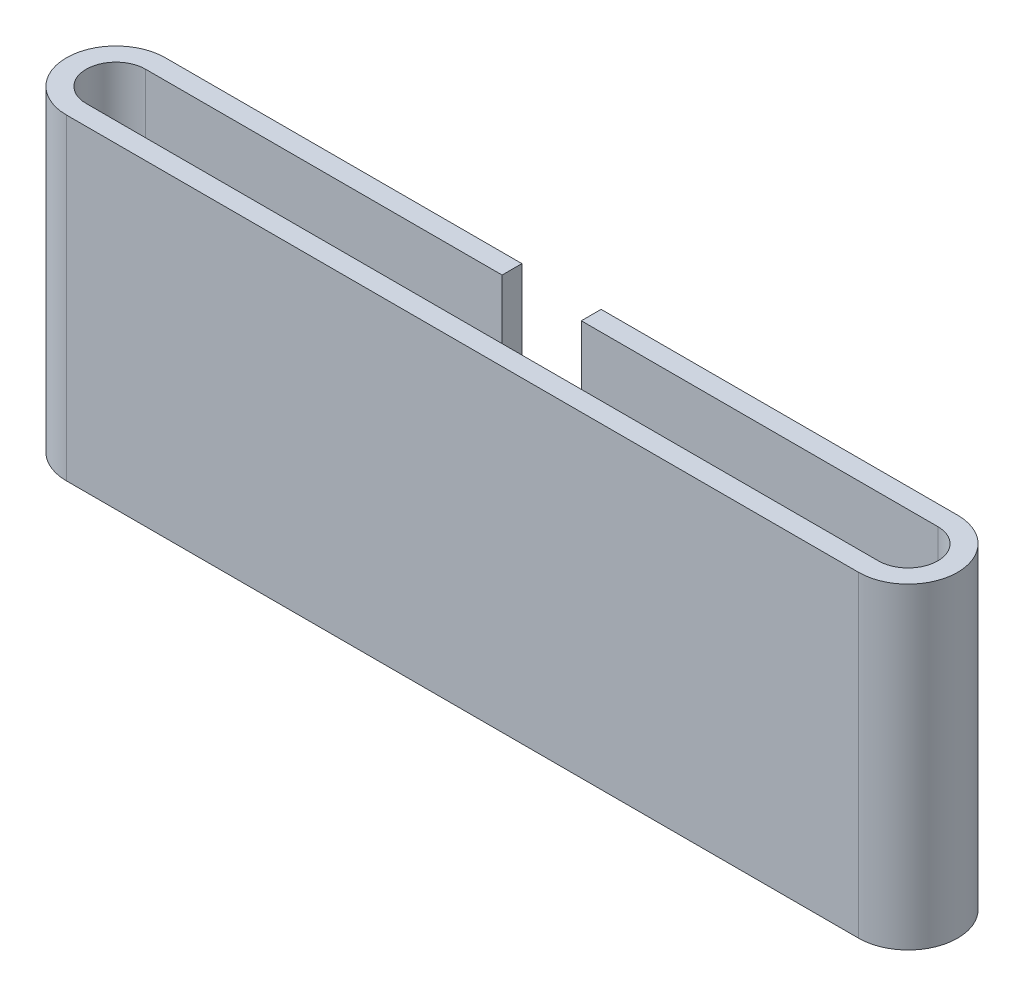
ISO-10303-21;
HEADER;
FILE_DESCRIPTION(('STEP AP214'),'2;1');
FILE_NAME('part.step','',(''),(''),'','','');
FILE_SCHEMA(('AUTOMOTIVE_DESIGN { 1 0 10303 214 1 1 1 1 }'));
ENDSEC;
DATA;
#1=APPLICATION_CONTEXT('core data for automotive mechanical design processes');
#2=APPLICATION_PROTOCOL_DEFINITION('international standard','automotive_design',2000,#1);
#3=PRODUCT_CONTEXT('',#1,'mechanical');
#4=PRODUCT('Part','Part','',(#3));
#5=PRODUCT_RELATED_PRODUCT_CATEGORY('part','',(#4));
#6=PRODUCT_DEFINITION_FORMATION('','',#4);
#7=PRODUCT_DEFINITION_CONTEXT('part definition',#1,'design');
#8=PRODUCT_DEFINITION('design','',#6,#7);
#9=PRODUCT_DEFINITION_SHAPE('','',#8);
#10=(LENGTH_UNIT() NAMED_UNIT(*) SI_UNIT(.MILLI.,.METRE.));
#11=(NAMED_UNIT(*) PLANE_ANGLE_UNIT() SI_UNIT($,.RADIAN.));
#12=(NAMED_UNIT(*) SI_UNIT($,.STERADIAN.) SOLID_ANGLE_UNIT());
#13=UNCERTAINTY_MEASURE_WITH_UNIT(LENGTH_MEASURE(1.E-05),#10,'distance_accuracy_value','');
#14=(GEOMETRIC_REPRESENTATION_CONTEXT(3) GLOBAL_UNCERTAINTY_ASSIGNED_CONTEXT((#13)) GLOBAL_UNIT_ASSIGNED_CONTEXT((#10,
#11,#12)) REPRESENTATION_CONTEXT('',''));
#15=CARTESIAN_POINT('',(0.,0.,0.));
#16=DIRECTION('',(0.,0.,1.));
#17=DIRECTION('',(1.,0.,0.));
#18=AXIS2_PLACEMENT_3D('',#15,#16,#17);
#19=CARTESIAN_POINT('',(-20.,30.,-3.));
#20=DIRECTION('',(0.,0.,1.));
#21=DIRECTION('',(1.,0.,0.));
#22=AXIS2_PLACEMENT_3D('',#19,#20,#21);
#23=PLANE('',#22);
#24=DIRECTION('',(0.,1.,0.));
#25=VECTOR('',#24,1.);
#26=CARTESIAN_POINT('',(24.,30.,-3.));
#27=LINE('',#26,#25);
#28=CARTESIAN_POINT('',(24.,0.,-3.00000000000001));
#29=VERTEX_POINT('',#28);
#30=CARTESIAN_POINT('',(24.,30.,-3.));
#31=VERTEX_POINT('',#30);
#32=EDGE_CURVE('E171',#29,#31,#27,.T.);
#33=ORIENTED_EDGE('',*,*,#32,.F.);
#34=DIRECTION('',(-1.,0.,0.));
#35=VECTOR('',#34,1.);
#36=CARTESIAN_POINT('',(-20.,0.,-3.));
#37=LINE('',#36,#35);
#38=CARTESIAN_POINT('',(60.,0.,-3.));
#39=VERTEX_POINT('',#38);
#40=EDGE_CURVE('E138',#39,#29,#37,.T.);
#41=ORIENTED_EDGE('',*,*,#40,.F.);
#42=DIRECTION('',(0.,-1.,0.));
#43=VECTOR('',#42,1.);
#44=CARTESIAN_POINT('',(60.,30.,-3.));
#45=LINE('',#44,#43);
#46=CARTESIAN_POINT('',(60.,30.,-3.));
#47=VERTEX_POINT('',#46);
#48=EDGE_CURVE('E67',#47,#39,#45,.T.);
#49=ORIENTED_EDGE('',*,*,#48,.F.);
#50=DIRECTION('',(-1.,0.,0.));
#51=VECTOR('',#50,1.);
#52=CARTESIAN_POINT('',(-20.,30.,-3.));
#53=LINE('',#52,#51);
#54=EDGE_CURVE('E201',#47,#31,#53,.T.);
#55=ORIENTED_EDGE('',*,*,#54,.T.);
#56=EDGE_LOOP('',(#33,#41,#49,#55));
#57=FACE_BOUND('',#56,.T.);
#58=ADVANCED_FACE('F43',(#57),#23,.T.);
#59=CARTESIAN_POINT('',(-20.,30.,0.));
#60=DIRECTION('',(0.,1.,0.));
#61=DIRECTION('',(0.,0.,1.));
#62=AXIS2_PLACEMENT_3D('',#59,#60,#61);
#63=PLANE('',#62);
#64=DIRECTION('',(0.,0.,-1.));
#65=VECTOR('',#64,1.);
#66=CARTESIAN_POINT('',(24.,30.,-2.647607435979));
#67=LINE('',#66,#65);
#68=CARTESIAN_POINT('',(24.,30.,-5.));
#69=VERTEX_POINT('',#68);
#70=EDGE_CURVE('E148',#31,#69,#67,.T.);
#71=ORIENTED_EDGE('',*,*,#70,.F.);
#72=ORIENTED_EDGE('',*,*,#54,.F.);
#73=CARTESIAN_POINT('',(60.,30.,0.));
#74=DIRECTION('',(0.,1.,0.));
#75=DIRECTION('',(0.,0.,1.));
#76=AXIS2_PLACEMENT_3D('',#73,#74,#75);
#77=CIRCLE('',#76,3.);
#78=CARTESIAN_POINT('',(60.,30.,2.99999999999999));
#79=VERTEX_POINT('',#78);
#80=EDGE_CURVE('E197',#79,#47,#77,.T.);
#81=ORIENTED_EDGE('',*,*,#80,.F.);
#82=DIRECTION('',(1.,0.,0.));
#83=VECTOR('',#82,1.);
#84=CARTESIAN_POINT('',(-20.,30.,3.));
#85=LINE('',#84,#83);
#86=CARTESIAN_POINT('',(-20.,30.,3.));
#87=VERTEX_POINT('',#86);
#88=EDGE_CURVE('E194',#87,#79,#85,.T.);
#89=ORIENTED_EDGE('',*,*,#88,.F.);
#90=CARTESIAN_POINT('',(-20.,30.,0.));
#91=DIRECTION('',(0.,1.,0.));
#92=DIRECTION('',(0.,0.,1.));
#93=AXIS2_PLACEMENT_3D('',#90,#91,#92);
#94=CIRCLE('',#93,3.);
#95=CARTESIAN_POINT('',(-20.,30.,-3.));
#96=VERTEX_POINT('',#95);
#97=EDGE_CURVE('E191',#96,#87,#94,.T.);
#98=ORIENTED_EDGE('',*,*,#97,.F.);
#99=CARTESIAN_POINT('',(16.,30.,-3.));
#100=VERTEX_POINT('',#99);
#101=EDGE_CURVE('E200',#100,#96,#53,.T.);
#102=ORIENTED_EDGE('',*,*,#101,.F.);
#103=DIRECTION('',(0.,0.,1.));
#104=VECTOR('',#103,1.);
#105=CARTESIAN_POINT('',(16.,30.,-2.647607435979));
#106=LINE('',#105,#104);
#107=CARTESIAN_POINT('',(16.,30.,-5.));
#108=VERTEX_POINT('',#107);
#109=EDGE_CURVE('E142',#108,#100,#106,.T.);
#110=ORIENTED_EDGE('',*,*,#109,.F.);
#111=DIRECTION('',(-1.,0.,0.));
#112=VECTOR('',#111,1.);
#113=CARTESIAN_POINT('',(-20.,30.,-5.));
#114=LINE('',#113,#112);
#115=CARTESIAN_POINT('',(-20.,30.,-5.));
#116=VERTEX_POINT('',#115);
#117=EDGE_CURVE('E240',#108,#116,#114,.T.);
#118=ORIENTED_EDGE('',*,*,#117,.T.);
#119=CARTESIAN_POINT('',(-20.,30.,0.));
#120=DIRECTION('',(0.,1.,0.));
#121=DIRECTION('',(0.,0.,1.));
#122=AXIS2_PLACEMENT_3D('',#119,#120,#121);
#123=CIRCLE('',#122,5.);
#124=CARTESIAN_POINT('',(-20.,30.,5.));
#125=VERTEX_POINT('',#124);
#126=EDGE_CURVE('E230',#116,#125,#123,.T.);
#127=ORIENTED_EDGE('',*,*,#126,.T.);
#128=DIRECTION('',(1.,0.,0.));
#129=VECTOR('',#128,1.);
#130=CARTESIAN_POINT('',(-20.,30.,5.));
#131=LINE('',#130,#129);
#132=CARTESIAN_POINT('',(60.,30.,4.99999999999999));
#133=VERTEX_POINT('',#132);
#134=EDGE_CURVE('E234',#125,#133,#131,.T.);
#135=ORIENTED_EDGE('',*,*,#134,.T.);
#136=CARTESIAN_POINT('',(60.,30.,0.));
#137=DIRECTION('',(0.,1.,0.));
#138=DIRECTION('',(0.,0.,1.));
#139=AXIS2_PLACEMENT_3D('',#136,#137,#138);
#140=CIRCLE('',#139,5.);
#141=CARTESIAN_POINT('',(60.,30.,-5.));
#142=VERTEX_POINT('',#141);
#143=EDGE_CURVE('E237',#133,#142,#140,.T.);
#144=ORIENTED_EDGE('',*,*,#143,.T.);
#145=EDGE_CURVE('E241',#142,#69,#114,.T.);
#146=ORIENTED_EDGE('',*,*,#145,.T.);
#147=EDGE_LOOP('',(#71,#72,#81,#89,#98,#102,#110,#118,#127,#135,#144,#146));
#148=FACE_BOUND('',#147,.T.);
#149=ADVANCED_FACE('F268',(#148),#63,.T.);
#150=CARTESIAN_POINT('',(-20.,30.,0.));
#151=DIRECTION('',(0.,-1.,0.));
#152=DIRECTION('',(0.,0.,-1.));
#153=AXIS2_PLACEMENT_3D('',#150,#151,#152);
#154=CYLINDRICAL_SURFACE('',#153,5.);
#155=DIRECTION('',(0.,-1.,0.));
#156=VECTOR('',#155,1.);
#157=CARTESIAN_POINT('',(-20.,30.,-5.));
#158=LINE('',#157,#156);
#159=CARTESIAN_POINT('',(-20.,-2.,-5.));
#160=VERTEX_POINT('',#159);
#161=EDGE_CURVE('E244',#116,#160,#158,.T.);
#162=ORIENTED_EDGE('',*,*,#161,.T.);
#163=CARTESIAN_POINT('',(-20.,-2.,0.));
#164=DIRECTION('',(0.,-1.,0.));
#165=DIRECTION('',(0.,0.,-1.));
#166=AXIS2_PLACEMENT_3D('',#163,#164,#165);
#167=CIRCLE('',#166,5.);
#168=CARTESIAN_POINT('',(-20.,-2.,5.));
#169=VERTEX_POINT('',#168);
#170=EDGE_CURVE('E174',#169,#160,#167,.T.);
#171=ORIENTED_EDGE('',*,*,#170,.F.);
#172=DIRECTION('',(0.,-1.,0.));
#173=VECTOR('',#172,1.);
#174=CARTESIAN_POINT('',(-20.,30.,5.));
#175=LINE('',#174,#173);
#176=EDGE_CURVE('E11',#125,#169,#175,.T.);
#177=ORIENTED_EDGE('',*,*,#176,.F.);
#178=ORIENTED_EDGE('',*,*,#126,.F.);
#179=EDGE_LOOP('',(#162,#171,#177,#178));
#180=FACE_BOUND('',#179,.T.);
#181=ADVANCED_FACE('F45',(#180),#154,.T.);
#182=CARTESIAN_POINT('',(-20.,30.,5.));
#183=DIRECTION('',(0.,0.,-1.));
#184=DIRECTION('',(-1.,0.,0.));
#185=AXIS2_PLACEMENT_3D('',#182,#183,#184);
#186=PLANE('',#185);
#187=ORIENTED_EDGE('',*,*,#176,.T.);
#188=DIRECTION('',(-1.,0.,0.));
#189=VECTOR('',#188,1.);
#190=CARTESIAN_POINT('',(60.,-2.,4.99999999999998));
#191=LINE('',#190,#189);
#192=CARTESIAN_POINT('',(60.,-2.,4.99999999999998));
#193=VERTEX_POINT('',#192);
#194=EDGE_CURVE('E186',#193,#169,#191,.T.);
#195=ORIENTED_EDGE('',*,*,#194,.F.);
#196=DIRECTION('',(0.,-1.,0.));
#197=VECTOR('',#196,1.);
#198=CARTESIAN_POINT('',(60.,30.,4.99999999999999));
#199=LINE('',#198,#197);
#200=EDGE_CURVE('E52',#133,#193,#199,.T.);
#201=ORIENTED_EDGE('',*,*,#200,.F.);
#202=ORIENTED_EDGE('',*,*,#134,.F.);
#203=EDGE_LOOP('',(#187,#195,#201,#202));
#204=FACE_BOUND('',#203,.T.);
#205=ADVANCED_FACE('F262',(#204),#186,.F.);
#206=CARTESIAN_POINT('',(60.,30.,0.));
#207=DIRECTION('',(0.,-1.,0.));
#208=DIRECTION('',(0.,0.,-1.));
#209=AXIS2_PLACEMENT_3D('',#206,#207,#208);
#210=CYLINDRICAL_SURFACE('',#209,5.);
#211=ORIENTED_EDGE('',*,*,#200,.T.);
#212=CARTESIAN_POINT('',(60.,-2.,0.));
#213=DIRECTION('',(0.,-1.,0.));
#214=DIRECTION('',(0.,0.,-1.));
#215=AXIS2_PLACEMENT_3D('',#212,#213,#214);
#216=CIRCLE('',#215,4.99999999999999);
#217=CARTESIAN_POINT('',(60.,-2.,-5.00000000000001));
#218=VERTEX_POINT('',#217);
#219=EDGE_CURVE('E182',#218,#193,#216,.T.);
#220=ORIENTED_EDGE('',*,*,#219,.F.);
#221=DIRECTION('',(0.,-1.,0.));
#222=VECTOR('',#221,1.);
#223=CARTESIAN_POINT('',(60.,30.,-5.));
#224=LINE('',#223,#222);
#225=EDGE_CURVE('E247',#142,#218,#224,.T.);
#226=ORIENTED_EDGE('',*,*,#225,.F.);
#227=ORIENTED_EDGE('',*,*,#143,.F.);
#228=EDGE_LOOP('',(#211,#220,#226,#227));
#229=FACE_BOUND('',#228,.T.);
#230=ADVANCED_FACE('F254',(#229),#210,.T.);
#231=CARTESIAN_POINT('',(-20.,30.,-5.));
#232=DIRECTION('',(0.,0.,1.));
#233=DIRECTION('',(1.,0.,0.));
#234=AXIS2_PLACEMENT_3D('',#231,#232,#233);
#235=PLANE('',#234);
#236=DIRECTION('',(-1.,0.,0.));
#237=VECTOR('',#236,1.);
#238=CARTESIAN_POINT('',(16.,0.,-5.));
#239=LINE('',#238,#237);
#240=CARTESIAN_POINT('',(24.,0.,-5.));
#241=VERTEX_POINT('',#240);
#242=CARTESIAN_POINT('',(16.,0.,-5.));
#243=VERTEX_POINT('',#242);
#244=EDGE_CURVE('E135',#241,#243,#239,.T.);
#245=ORIENTED_EDGE('',*,*,#244,.F.);
#246=DIRECTION('',(0.,1.,0.));
#247=VECTOR('',#246,1.);
#248=CARTESIAN_POINT('',(24.,0.,-5.));
#249=LINE('',#248,#247);
#250=EDGE_CURVE('E145',#241,#69,#249,.T.);
#251=ORIENTED_EDGE('',*,*,#250,.T.);
#252=ORIENTED_EDGE('',*,*,#145,.F.);
#253=ORIENTED_EDGE('',*,*,#225,.T.);
#254=DIRECTION('',(1.,0.,0.));
#255=VECTOR('',#254,1.);
#256=CARTESIAN_POINT('',(-20.,-2.,-5.));
#257=LINE('',#256,#255);
#258=EDGE_CURVE('E178',#160,#218,#257,.T.);
#259=ORIENTED_EDGE('',*,*,#258,.F.);
#260=ORIENTED_EDGE('',*,*,#161,.F.);
#261=ORIENTED_EDGE('',*,*,#117,.F.);
#262=DIRECTION('',(0.,1.,0.));
#263=VECTOR('',#262,1.);
#264=CARTESIAN_POINT('',(16.,0.,-5.));
#265=LINE('',#264,#263);
#266=EDGE_CURVE('E153',#243,#108,#265,.T.);
#267=ORIENTED_EDGE('',*,*,#266,.F.);
#268=EDGE_LOOP('',(#245,#251,#252,#253,#259,#260,#261,#267));
#269=FACE_BOUND('',#268,.T.);
#270=ADVANCED_FACE('F155',(#269),#235,.F.);
#271=CARTESIAN_POINT('',(-20.,30.,0.));
#272=DIRECTION('',(0.,-1.,0.));
#273=DIRECTION('',(0.,0.,-1.));
#274=AXIS2_PLACEMENT_3D('',#271,#272,#273);
#275=CYLINDRICAL_SURFACE('',#274,3.);
#276=CARTESIAN_POINT('',(-20.,0.,0.));
#277=DIRECTION('',(0.,1.,0.));
#278=DIRECTION('',(0.,0.,1.));
#279=AXIS2_PLACEMENT_3D('',#276,#277,#278);
#280=CIRCLE('',#279,3.);
#281=CARTESIAN_POINT('',(-20.,0.,-3.));
#282=VERTEX_POINT('',#281);
#283=CARTESIAN_POINT('',(-20.,0.,3.));
#284=VERTEX_POINT('',#283);
#285=EDGE_CURVE('E190',#282,#284,#280,.T.);
#286=ORIENTED_EDGE('',*,*,#285,.F.);
#287=DIRECTION('',(0.,-1.,0.));
#288=VECTOR('',#287,1.);
#289=CARTESIAN_POINT('',(-20.,30.,-3.));
#290=LINE('',#289,#288);
#291=EDGE_CURVE('E204',#96,#282,#290,.T.);
#292=ORIENTED_EDGE('',*,*,#291,.F.);
#293=ORIENTED_EDGE('',*,*,#97,.T.);
#294=DIRECTION('',(0.,-1.,0.));
#295=VECTOR('',#294,1.);
#296=CARTESIAN_POINT('',(-20.,30.,3.));
#297=LINE('',#296,#295);
#298=EDGE_CURVE('E226',#87,#284,#297,.T.);
#299=ORIENTED_EDGE('',*,*,#298,.T.);
#300=EDGE_LOOP('',(#286,#292,#293,#299));
#301=FACE_BOUND('',#300,.T.);
#302=ADVANCED_FACE('F283',(#301),#275,.F.);
#303=CARTESIAN_POINT('',(-20.,30.,3.));
#304=DIRECTION('',(0.,0.,-1.));
#305=DIRECTION('',(-1.,0.,0.));
#306=AXIS2_PLACEMENT_3D('',#303,#304,#305);
#307=PLANE('',#306);
#308=DIRECTION('',(1.,0.,0.));
#309=VECTOR('',#308,1.);
#310=CARTESIAN_POINT('',(-20.,0.,3.));
#311=LINE('',#310,#309);
#312=CARTESIAN_POINT('',(60.,0.,2.99999999999999));
#313=VERTEX_POINT('',#312);
#314=EDGE_CURVE('E208',#284,#313,#311,.T.);
#315=ORIENTED_EDGE('',*,*,#314,.F.);
#316=ORIENTED_EDGE('',*,*,#298,.F.);
#317=ORIENTED_EDGE('',*,*,#88,.T.);
#318=DIRECTION('',(0.,-1.,0.));
#319=VECTOR('',#318,1.);
#320=CARTESIAN_POINT('',(60.,30.,2.99999999999999));
#321=LINE('',#320,#319);
#322=EDGE_CURVE('E223',#79,#313,#321,.T.);
#323=ORIENTED_EDGE('',*,*,#322,.T.);
#324=EDGE_LOOP('',(#315,#316,#317,#323));
#325=FACE_BOUND('',#324,.T.);
#326=ADVANCED_FACE('F287',(#325),#307,.T.);
#327=CARTESIAN_POINT('',(60.,30.,0.));
#328=DIRECTION('',(0.,-1.,0.));
#329=DIRECTION('',(0.,0.,-1.));
#330=AXIS2_PLACEMENT_3D('',#327,#328,#329);
#331=CYLINDRICAL_SURFACE('',#330,3.);
#332=CARTESIAN_POINT('',(60.,0.,0.));
#333=DIRECTION('',(0.,1.,0.));
#334=DIRECTION('',(0.,0.,1.));
#335=AXIS2_PLACEMENT_3D('',#332,#333,#334);
#336=CIRCLE('',#335,3.);
#337=EDGE_CURVE('E212',#313,#39,#336,.T.);
#338=ORIENTED_EDGE('',*,*,#337,.F.);
#339=ORIENTED_EDGE('',*,*,#322,.F.);
#340=ORIENTED_EDGE('',*,*,#80,.T.);
#341=ORIENTED_EDGE('',*,*,#48,.T.);
#342=EDGE_LOOP('',(#338,#339,#340,#341));
#343=FACE_BOUND('',#342,.T.);
#344=ADVANCED_FACE('F292',(#343),#331,.F.);
#345=DIRECTION('',(0.,-1.,0.));
#346=VECTOR('',#345,1.);
#347=CARTESIAN_POINT('',(16.,30.,-3.));
#348=LINE('',#347,#346);
#349=CARTESIAN_POINT('',(16.,0.,-3.));
#350=VERTEX_POINT('',#349);
#351=EDGE_CURVE('E167',#100,#350,#348,.T.);
#352=ORIENTED_EDGE('',*,*,#351,.F.);
#353=ORIENTED_EDGE('',*,*,#101,.T.);
#354=ORIENTED_EDGE('',*,*,#291,.T.);
#355=EDGE_CURVE('E215',#350,#282,#37,.T.);
#356=ORIENTED_EDGE('',*,*,#355,.F.);
#357=EDGE_LOOP('',(#352,#353,#354,#356));
#358=FACE_BOUND('',#357,.T.);
#359=ADVANCED_FACE('F280',(#358),#23,.T.);
#360=CARTESIAN_POINT('',(-20.,0.,0.));
#361=DIRECTION('',(0.,-1.,0.));
#362=DIRECTION('',(0.,0.,-1.));
#363=AXIS2_PLACEMENT_3D('',#360,#361,#362);
#364=PLANE('',#363);
#365=ORIENTED_EDGE('',*,*,#40,.T.);
#366=DIRECTION('',(0.,0.,-1.));
#367=VECTOR('',#366,1.);
#368=CARTESIAN_POINT('',(24.,0.,-2.647607435979));
#369=LINE('',#368,#367);
#370=EDGE_CURVE('E131',#29,#241,#369,.T.);
#371=ORIENTED_EDGE('',*,*,#370,.T.);
#372=ORIENTED_EDGE('',*,*,#244,.T.);
#373=DIRECTION('',(0.,0.,1.));
#374=VECTOR('',#373,1.);
#375=CARTESIAN_POINT('',(16.,0.,-2.647607435979));
#376=LINE('',#375,#374);
#377=EDGE_CURVE('E59',#243,#350,#376,.T.);
#378=ORIENTED_EDGE('',*,*,#377,.T.);
#379=ORIENTED_EDGE('',*,*,#355,.T.);
#380=ORIENTED_EDGE('',*,*,#285,.T.);
#381=ORIENTED_EDGE('',*,*,#314,.T.);
#382=ORIENTED_EDGE('',*,*,#337,.T.);
#383=EDGE_LOOP('',(#365,#371,#372,#378,#379,#380,#381,#382));
#384=FACE_BOUND('',#383,.T.);
#385=ADVANCED_FACE('F133',(#384),#364,.F.);
#386=CARTESIAN_POINT('',(-20.,-2.,0.));
#387=DIRECTION('',(0.,-1.,0.));
#388=DIRECTION('',(0.,0.,-1.));
#389=AXIS2_PLACEMENT_3D('',#386,#387,#388);
#390=PLANE('',#389);
#391=ORIENTED_EDGE('',*,*,#170,.T.);
#392=ORIENTED_EDGE('',*,*,#258,.T.);
#393=ORIENTED_EDGE('',*,*,#219,.T.);
#394=ORIENTED_EDGE('',*,*,#194,.T.);
#395=EDGE_LOOP('',(#391,#392,#393,#394));
#396=FACE_BOUND('',#395,.T.);
#397=ADVANCED_FACE('F259',(#396),#390,.T.);
#398=CARTESIAN_POINT('',(24.,0.,-2.647607435979));
#399=DIRECTION('',(1.,0.,0.));
#400=DIRECTION('',(0.,0.,-1.));
#401=AXIS2_PLACEMENT_3D('',#398,#399,#400);
#402=PLANE('',#401);
#403=ORIENTED_EDGE('',*,*,#32,.T.);
#404=ORIENTED_EDGE('',*,*,#70,.T.);
#405=ORIENTED_EDGE('',*,*,#250,.F.);
#406=ORIENTED_EDGE('',*,*,#370,.F.);
#407=EDGE_LOOP('',(#403,#404,#405,#406));
#408=FACE_BOUND('',#407,.T.);
#409=ADVANCED_FACE('F146',(#408),#402,.F.);
#410=CARTESIAN_POINT('',(16.,0.,-2.647607435979));
#411=DIRECTION('',(-1.,0.,0.));
#412=DIRECTION('',(0.,0.,1.));
#413=AXIS2_PLACEMENT_3D('',#410,#411,#412);
#414=PLANE('',#413);
#415=ORIENTED_EDGE('',*,*,#351,.T.);
#416=ORIENTED_EDGE('',*,*,#377,.F.);
#417=ORIENTED_EDGE('',*,*,#266,.T.);
#418=ORIENTED_EDGE('',*,*,#109,.T.);
#419=EDGE_LOOP('',(#415,#416,#417,#418));
#420=FACE_BOUND('',#419,.T.);
#421=ADVANCED_FACE('F363',(#420),#414,.F.);
#422=CLOSED_SHELL('',(#58,#149,#181,#205,#230,#270,#302,#326,#344,#359,#385,#397,#409,#421));
#423=MANIFOLD_SOLID_BREP('B2',#422);
#424=ADVANCED_BREP_SHAPE_REPRESENTATION('',(#18,#423),#14);
#425=SHAPE_DEFINITION_REPRESENTATION(#9,#424);
ENDSEC;
END-ISO-10303-21;
